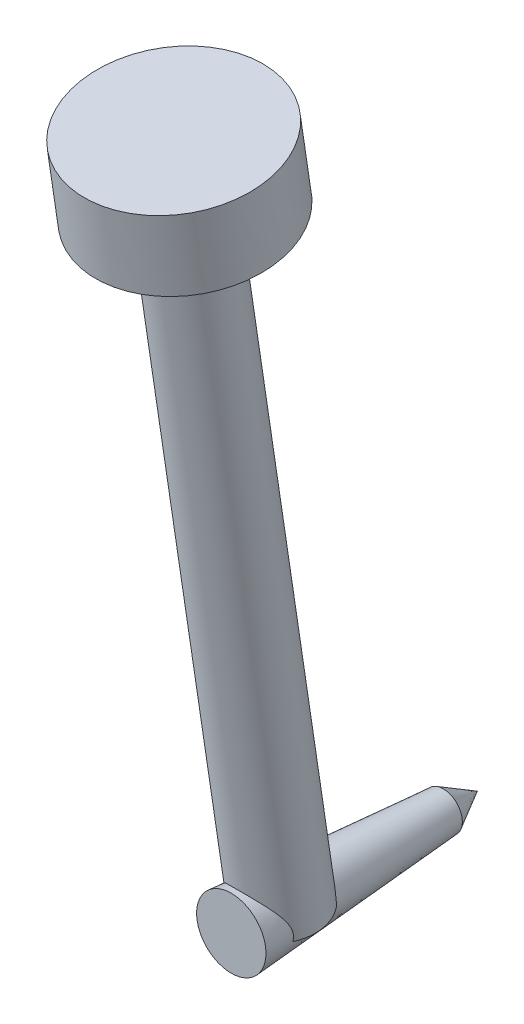
ISO-10303-21;
HEADER;
FILE_DESCRIPTION(('STEP AP214'),'2;1');
FILE_NAME('part.step','',(''),(''),'','','');
FILE_SCHEMA(('AUTOMOTIVE_DESIGN { 1 0 10303 214 1 1 1 1 }'));
ENDSEC;
DATA;
#1=APPLICATION_CONTEXT('core data for automotive mechanical design processes');
#2=APPLICATION_PROTOCOL_DEFINITION('international standard','automotive_design',2000,#1);
#3=PRODUCT_CONTEXT('',#1,'mechanical');
#4=PRODUCT('Part','Part','',(#3));
#5=PRODUCT_RELATED_PRODUCT_CATEGORY('part','',(#4));
#6=PRODUCT_DEFINITION_FORMATION('','',#4);
#7=PRODUCT_DEFINITION_CONTEXT('part definition',#1,'design');
#8=PRODUCT_DEFINITION('design','',#6,#7);
#9=PRODUCT_DEFINITION_SHAPE('','',#8);
#10=(LENGTH_UNIT() NAMED_UNIT(*) SI_UNIT(.MILLI.,.METRE.));
#11=(NAMED_UNIT(*) PLANE_ANGLE_UNIT() SI_UNIT($,.RADIAN.));
#12=(NAMED_UNIT(*) SI_UNIT($,.STERADIAN.) SOLID_ANGLE_UNIT());
#13=UNCERTAINTY_MEASURE_WITH_UNIT(LENGTH_MEASURE(1.E-05),#10,'distance_accuracy_value','');
#14=(GEOMETRIC_REPRESENTATION_CONTEXT(3) GLOBAL_UNCERTAINTY_ASSIGNED_CONTEXT((#13)) GLOBAL_UNIT_ASSIGNED_CONTEXT((#10,
#11,#12)) REPRESENTATION_CONTEXT('',''));
#15=CARTESIAN_POINT('',(0.,0.,0.));
#16=DIRECTION('',(0.,0.,1.));
#17=DIRECTION('',(1.,0.,0.));
#18=AXIS2_PLACEMENT_3D('',#15,#16,#17);
#19=CARTESIAN_POINT('',(357.476877600853,178.279448858378,9.56213503554672));
#20=DIRECTION('',(0.,-0.988978398446851,-0.148059877770789));
#21=DIRECTION('',(0.,0.148059877770789,-0.988978398446851));
#22=AXIS2_PLACEMENT_3D('',#19,#20,#21);
#23=PLANE('',#22);
#24=CARTESIAN_POINT('',(357.476877600853,178.225282840253,9.92394150643039));
#25=DIRECTION('',(0.,-0.988978398446851,-0.148059877770789));
#26=DIRECTION('',(0.,0.148059877770789,-0.988978398446851));
#27=AXIS2_PLACEMENT_3D('',#24,#25,#26);
#28=CIRCLE('',#27,0.731677196290517);
#29=CARTESIAN_POINT('',(357.476877600853,178.333614876503,9.20032856466291));
#30=VERTEX_POINT('',#29);
#31=EDGE_CURVE('E20',#30,#30,#28,.T.);
#32=ORIENTED_EDGE('',*,*,#31,.F.);
#33=EDGE_LOOP('',(#32));
#34=FACE_BOUND('',#33,.T.);
#35=ADVANCED_FACE('F17',(#34),#23,.F.);
#36=CARTESIAN_POINT('',(357.476877600853,172.360827,7.73884299985639));
#37=DIRECTION('',(0.,0.,1.));
#38=DIRECTION('',(1.,0.,0.));
#39=AXIS2_PLACEMENT_3D('',#36,#37,#38);
#40=CONICAL_SURFACE('',#39,0.154049999870676,0.510213050166803);
#41=CARTESIAN_POINT('',(357.476877600853,172.360827,7.73884300002692));
#42=DIRECTION('',(0.,0.,1.));
#43=DIRECTION('',(1.,0.,0.));
#44=AXIS2_PLACEMENT_3D('',#41,#42,#43);
#45=CIRCLE('',#44,0.154049999998573);
#46=CARTESIAN_POINT('',(357.630927600852,172.360827,7.73884300002692));
#47=VERTEX_POINT('',#46);
#48=EDGE_CURVE('E107',#47,#47,#45,.T.);
#49=ORIENTED_EDGE('',*,*,#48,.F.);
#50=EDGE_LOOP('',(#49));
#51=FACE_BOUND('',#50,.T.);
#52=CARTESIAN_POINT('',(357.476877600817,172.360827,7.46357599990688));
#53=VERTEX_POINT('',#52);
#54=VERTEX_LOOP('',#53);
#55=FACE_BOUND('',#54,.T.);
#56=ADVANCED_FACE('F43',(#51,#55),#40,.T.);
#57=CARTESIAN_POINT('',(357.476877600853,177.9184488255,9.87800541036244));
#58=DIRECTION('',(0.,-0.988978398446851,-0.148059877770789));
#59=DIRECTION('',(0.,0.148059877770789,-0.988978398446851));
#60=AXIS2_PLACEMENT_3D('',#57,#58,#59);
#61=CYLINDRICAL_SURFACE('',#60,0.731677196290517);
#62=ORIENTED_EDGE('',*,*,#31,.T.);
#63=EDGE_LOOP('',(#62));
#64=FACE_BOUND('',#63,.T.);
#65=CARTESIAN_POINT('',(357.476877600853,177.611614810746,9.83206931429434));
#66=DIRECTION('',(0.,-0.988978398446851,-0.148059877770789));
#67=DIRECTION('',(0.,0.148059877770789,-0.988978398446851));
#68=AXIS2_PLACEMENT_3D('',#65,#66,#67);
#69=CIRCLE('',#68,0.731677196290517);
#70=CARTESIAN_POINT('',(357.476877600853,177.719946846997,9.10845637252686));
#71=VERTEX_POINT('',#70);
#72=EDGE_CURVE('E106',#71,#71,#69,.T.);
#73=ORIENTED_EDGE('',*,*,#72,.F.);
#74=EDGE_LOOP('',(#73));
#75=FACE_BOUND('',#74,.T.);
#76=ADVANCED_FACE('F45',(#64,#75),#61,.T.);
#77=CARTESIAN_POINT('',(357.476877600853,172.337205102617,9.04243785426944));
#78=DIRECTION('',(0.,0.988978398446817,0.148059877771019));
#79=DIRECTION('',(0.,-0.148059877771019,0.988978398446817));
#80=AXIS2_PLACEMENT_3D('',#77,#78,#79);
#81=CONICAL_SURFACE('',#80,0.312978180908462,1.53269300439733);
#82=CARTESIAN_POINT('',(357.476877600853,172.337205102623,9.04243785427028));
#83=DIRECTION('',(0.,-0.988978398446851,-0.148059877770789));
#84=DIRECTION('',(0.,0.148059877770789,-0.988978398446851));
#85=AXIS2_PLACEMENT_3D('',#82,#83,#84);
#86=CIRCLE('',#85,0.312978180992954);
#87=CARTESIAN_POINT('',(357.241764602328,172.367791985794,8.83813018186664));
#88=VERTEX_POINT('',#87);
#89=CARTESIAN_POINT('',(357.218432545844,172.311068656703,9.21701844168529));
#90=VERTEX_POINT('',#89);
#91=EDGE_CURVE('E124',#88,#90,#86,.F.);
#92=ORIENTED_EDGE('',*,*,#91,.F.);
#93=CARTESIAN_POINT('',(357.218432545847,172.311068656696,9.21701844165659));
#94=CARTESIAN_POINT('',(357.219877363652,172.314633928591,9.1887282875016));
#95=CARTESIAN_POINT('',(357.221355076283,172.318297445781,9.1604509872636));
#96=CARTESIAN_POINT('',(357.224412942472,172.325909132803,9.10394013945038));
#97=CARTESIAN_POINT('',(357.225993097119,172.329857305659,9.07570659234309));
#98=CARTESIAN_POINT('',(357.229291879377,172.338124915108,9.01931198559052));
#99=CARTESIAN_POINT('',(357.231010457254,172.342444218394,8.99115090362851));
#100=CARTESIAN_POINT('',(357.234660214611,172.351414319218,8.93489606017152));
#101=CARTESIAN_POINT('',(357.236591390378,172.356065110965,8.9068022975094));
#102=CARTESIAN_POINT('',(357.239662967337,172.363124823311,8.86519534376648));
#103=CARTESIAN_POINT('',(357.240695477896,172.36544853837,8.85165961852112));
#104=CARTESIAN_POINT('',(357.241764594651,172.367791968896,8.83813027939944));
#105=B_SPLINE_CURVE_WITH_KNOTS('',3,(#93,#94,#95,#96,#97,#98,#99,#100,#101,#102,#103,#104),
.UNSPECIFIED.,.F.,.F.,(4,2,2,2,2,4),(0.,0.0856532156522986,0.171307341095662,0.256930827369804,
0.342552818265336,0.383869998526581),.UNSPECIFIED.);
#106=EDGE_CURVE('E101',#90,#88,#105,.T.);
#107=ORIENTED_EDGE('',*,*,#106,.F.);
#108=EDGE_LOOP('',(#92,#107));
#109=FACE_BOUND('',#108,.T.);
#110=ADVANCED_FACE('F52',(#109),#81,.T.);
#111=CARTESIAN_POINT('',(357.476877600853,172.516053706015,9.45711871768881));
#112=DIRECTION('',(0.,0.,1.));
#113=DIRECTION('',(1.,0.,0.));
#114=AXIS2_PLACEMENT_3D('',#111,#112,#113);
#115=PLANE('',#114);
#116=CARTESIAN_POINT('',(357.476877600853,172.360827,9.45711871770527));
#117=DIRECTION('',(0.,0.,1.));
#118=DIRECTION('',(1.,0.,0.));
#119=AXIS2_PLACEMENT_3D('',#116,#117,#118);
#120=CIRCLE('',#119,0.280919313004159);
#121=CARTESIAN_POINT('',(357.757796913857,172.360827,9.45711871770527));
#122=VERTEX_POINT('',#121);
#123=EDGE_CURVE('E86',#122,#122,#120,.F.);
#124=ORIENTED_EDGE('',*,*,#123,.F.);
#125=EDGE_LOOP('',(#124));
#126=FACE_BOUND('',#125,.T.);
#127=ADVANCED_FACE('F93',(#126),#115,.T.);
#128=CARTESIAN_POINT('',(357.476877600853,172.337205102617,9.04243785426944));
#129=DIRECTION('',(0.,0.988978398446817,0.148059877771019));
#130=DIRECTION('',(0.,-0.148059877771019,0.988978398446817));
#131=AXIS2_PLACEMENT_3D('',#128,#129,#130);
#132=CONICAL_SURFACE('',#131,0.312978180908462,1.53269300449122);
#133=CARTESIAN_POINT('',(357.476877600853,172.337205102624,9.04243785427042));
#134=DIRECTION('',(0.,-0.988978398446851,-0.148059877770789));
#135=DIRECTION('',(0.,0.148059877770789,-0.988978398446851));
#136=AXIS2_PLACEMENT_3D('',#133,#134,#135);
#137=CIRCLE('',#136,0.312978180992954);
#138=CARTESIAN_POINT('',(357.735322653303,172.311068663077,9.21701839111004));
#139=VERTEX_POINT('',#138);
#140=CARTESIAN_POINT('',(357.711990599439,172.367791981331,8.8381301812762));
#141=VERTEX_POINT('',#140);
#142=EDGE_CURVE('E85',#139,#141,#137,.F.);
#143=ORIENTED_EDGE('',*,*,#142,.F.);
#144=CARTESIAN_POINT('',(357.711990606876,172.367791969061,8.83813027945933));
#145=CARTESIAN_POINT('',(357.713060195428,172.365447492697,8.85165915828462));
#146=CARTESIAN_POINT('',(357.714092598552,172.363124079712,8.86519485274302));
#147=CARTESIAN_POINT('',(357.71860169941,172.352760105966,8.92629698743199));
#148=CARTESIAN_POINT('',(357.721704389898,172.345017974174,8.9739431328546));
#149=CARTESIAN_POINT('',(357.727458185194,172.330639498512,9.06942919215804));
#150=CARTESIAN_POINT('',(357.73010927629,172.324003188217,9.11726911187718));
#151=CARTESIAN_POINT('',(357.733545235844,172.315464385764,9.18244108872751));
#152=CARTESIAN_POINT('',(357.734439810342,172.313247501999,9.19972730521269));
#153=CARTESIAN_POINT('',(357.735322650711,172.311068669454,9.2170183405484));
#154=B_SPLINE_CURVE_WITH_KNOTS('',3,(#144,#145,#146,#147,#148,#149,#150,#151,#152,#153),
.UNSPECIFIED.,.F.,.F.,(4,2,2,2,4),(0.,0.0413168526892225,0.18641354746014,0.331514646930496,
0.383866211119147),.UNSPECIFIED.);
#155=EDGE_CURVE('E34',#141,#139,#154,.T.);
#156=ORIENTED_EDGE('',*,*,#155,.F.);
#157=EDGE_LOOP('',(#143,#156));
#158=FACE_BOUND('',#157,.T.);
#159=ADVANCED_FACE('F91',(#158),#132,.T.);
#160=CARTESIAN_POINT('',(357.476877600853,177.688950584484,9.31549851331707));
#161=DIRECTION('',(0.,-0.988978398446851,-0.148059877770789));
#162=DIRECTION('',(0.,0.148059877770789,-0.988978398446851));
#163=AXIS2_PLACEMENT_3D('',#160,#161,#162);
#164=PLANE('',#163);
#165=ORIENTED_EDGE('',*,*,#72,.T.);
#166=EDGE_LOOP('',(#165));
#167=FACE_BOUND('',#166,.T.);
#168=CARTESIAN_POINT('',(357.476877600853,177.611614810747,9.8320693142945));
#169=DIRECTION('',(0.,-0.988978398446851,-0.148059877770789));
#170=DIRECTION('',(0.,0.148059877770789,-0.988978398446851));
#171=AXIS2_PLACEMENT_3D('',#168,#169,#170);
#172=CIRCLE('',#171,0.312978180992954);
#173=CARTESIAN_POINT('',(357.476877600853,177.65795432197,9.52254065410728));
#174=VERTEX_POINT('',#173);
#175=EDGE_CURVE('E11',#174,#174,#172,.T.);
#176=ORIENTED_EDGE('',*,*,#175,.F.);
#177=EDGE_LOOP('',(#176));
#178=FACE_BOUND('',#177,.T.);
#179=ADVANCED_FACE('F65',(#167,#178),#164,.T.);
#180=CARTESIAN_POINT('',(357.476877600853,172.360827,9.45711871753474));
#181=DIRECTION('',(0.,0.,1.));
#182=DIRECTION('',(1.,0.,0.));
#183=AXIS2_PLACEMENT_3D('',#180,#181,#182);
#184=CONICAL_SURFACE('',#183,0.280919312991568,0.0737015102587444);
#185=ORIENTED_EDGE('',*,*,#48,.T.);
#186=EDGE_LOOP('',(#185));
#187=FACE_BOUND('',#186,.T.);
#188=CARTESIAN_POINT('',(357.218432545848,172.31106865671,9.21701844171209));
#189=CARTESIAN_POINT('',(357.216919428819,172.319276991837,9.21599496318446));
#190=CARTESIAN_POINT('',(357.21576593107,172.327617927171,9.21548596499168));
#191=CARTESIAN_POINT('',(357.214186997009,172.344270898889,9.21554508384831));
#192=CARTESIAN_POINT('',(357.21375367365,172.352582239953,9.21610138699486));
#193=CARTESIAN_POINT('',(357.213546976312,172.373486670419,9.21890729924123));
#194=CARTESIAN_POINT('',(357.214251243519,172.385989362689,9.22190412693461));
#195=CARTESIAN_POINT('',(357.217100327657,172.410198232421,9.22988763585298));
#196=CARTESIAN_POINT('',(357.219254662911,172.421898580463,9.23488737594182));
#197=CARTESIAN_POINT('',(357.225847257256,172.448758208641,9.24825774675965));
#198=CARTESIAN_POINT('',(357.230847995697,172.463492234338,9.2571830633841));
#199=CARTESIAN_POINT('',(357.242900465868,172.491459164776,9.27593461617388));
#200=CARTESIAN_POINT('',(357.249956153392,172.504689105198,9.28576256469271));
#201=CARTESIAN_POINT('',(357.266556222692,172.530489588796,9.30604483237211));
#202=CARTESIAN_POINT('',(357.276217712239,172.5429818835,9.31650344476841));
#203=CARTESIAN_POINT('',(357.297921427348,172.566320554932,9.33673437480454));
#204=CARTESIAN_POINT('',(357.309957588303,172.577171002517,9.34650835648133));
#205=CARTESIAN_POINT('',(357.332675354928,172.593980686058,9.36196734636774));
#206=CARTESIAN_POINT('',(357.342734379987,172.600445060706,9.36801527551989));
#207=CARTESIAN_POINT('',(357.364111921263,172.612106314738,9.37903782352254));
#208=CARTESIAN_POINT('',(357.375429345254,172.617304280982,9.3840133622968));
#209=CARTESIAN_POINT('',(357.397200989659,172.62538774338,9.39179955376058));
#210=CARTESIAN_POINT('',(357.40748547777,172.628514108614,9.39483267629465));
#211=CARTESIAN_POINT('',(357.428628620539,172.63347946677,9.3996640744289));
#212=CARTESIAN_POINT('',(357.439485744851,172.635321720837,9.40146547789505));
#213=CARTESIAN_POINT('',(357.454844443228,172.636909165074,9.40301893309979));
#214=CARTESIAN_POINT('',(357.459236392672,172.637249129403,9.40335184091259));
#215=CARTESIAN_POINT('',(357.468043913292,172.637703540933,9.40379694974248));
#216=CARTESIAN_POINT('',(357.472459489648,172.637817936454,9.4039091001821));
#217=CARTESIAN_POINT('',(357.488573710478,172.637816473716,9.40390750396446));
#218=CARTESIAN_POINT('',(357.500287584959,172.637010889007,9.40311729998365));
#219=CARTESIAN_POINT('',(357.523312661182,172.633856263241,9.40003375426241));
#220=CARTESIAN_POINT('',(357.534622851967,172.631503599555,9.39773688455554));
#221=CARTESIAN_POINT('',(357.556420258617,172.62546295634,9.39187485102698));
#222=CARTESIAN_POINT('',(357.56691336571,172.621785876868,9.38832004420426));
#223=CARTESIAN_POINT('',(357.587003775477,172.613310981507,9.38019636600992));
#224=CARTESIAN_POINT('',(357.596600854615,172.608512886994,9.37562724254738));
#225=CARTESIAN_POINT('',(357.619089287618,172.595539902681,9.36341319944532));
#226=CARTESIAN_POINT('',(357.631433241881,172.586833064657,9.35532685095703));
#227=CARTESIAN_POINT('',(357.654093871914,172.567881629521,9.33817079040198));
#228=CARTESIAN_POINT('',(357.664405996171,172.557633668607,9.32909893961705));
#229=CARTESIAN_POINT('',(357.683387512486,172.535506951709,9.31025469015075));
#230=CARTESIAN_POINT('',(357.691995807327,172.523587375034,9.30046927677296));
#231=CARTESIAN_POINT('',(357.707244426072,172.498410965302,9.28107664229436));
#232=CARTESIAN_POINT('',(357.713885180015,172.48515442531,9.27146938268609));
#233=CARTESIAN_POINT('',(357.723536590016,172.461147338554,9.25589875927016));
#234=CARTESIAN_POINT('',(357.727042309751,172.450763107395,9.24967860205268));
#235=CARTESIAN_POINT('',(357.732915512755,172.429146958518,9.23827825749902));
#236=CARTESIAN_POINT('',(357.735286706714,172.417917945242,9.23309471255029));
#237=CARTESIAN_POINT('',(357.738068169384,172.398973458078,9.22605594697055));
#238=CARTESIAN_POINT('',(357.738880039829,172.391511714635,9.22368066487106));
#239=CARTESIAN_POINT('',(357.739926132791,172.376329781641,9.21977799422842));
#240=CARTESIAN_POINT('',(357.740160855477,172.368609821754,9.21824987240834));
#241=CARTESIAN_POINT('',(357.740000434824,172.352563066266,9.21610181653639));
#242=CARTESIAN_POINT('',(357.739565457992,172.344228258562,9.21554386358309));
#243=CARTESIAN_POINT('',(357.737983657894,172.327572951774,9.21548699832951));
#244=CARTESIAN_POINT('',(357.736832680565,172.319252822368,9.21599430751704));
#245=CARTESIAN_POINT('',(357.735322660694,172.311068683042,9.21701843850784));
#246=B_SPLINE_CURVE_WITH_KNOTS('',3,(#188,#189,#190,#191,#192,#193,#194,#195,#196,#197,#198,
#199,#200,#201,#202,#203,#204,#205,#206,#207,#208,#209,#210,#211,#212,#213,#214,#215,#216,#217,
#218,#219,#220,#221,#222,#223,#224,#225,#226,#227,#228,#229,#230,#231,#232,#233,#234,#235,#236,
#237,#238,#239,#240,#241,#242,#243,#244,#245),.UNSPECIFIED.,.F.,.F.,(4,2,2,2,2,2,2,2,2,2,2,2,2,
2,2,2,2,2,2,2,2,2,2,2,2,2,2,2,4),(0.,0.0252058480193424,0.0501337879346062,0.0884101600875615,
0.12694026270609,0.180460422798161,0.234084298382531,0.290706929914265,0.347186783887342,
0.387255792034662,0.427290289945087,0.460663024269322,0.493950692901809,0.507194227130227,
0.520440795216767,0.555508566331166,0.590658745692657,0.6255260095088,0.66040194870385,
0.711520616836844,0.762752525836631,0.815578515491329,0.868392950630392,0.906116014267364,
0.943714839158881,0.967273860569215,0.99081245801915,1.01580614480889,1.04094620898359),.UNSPECIFIED.);
#247=EDGE_CURVE('E78',#90,#139,#246,.T.);
#248=ORIENTED_EDGE('',*,*,#247,.F.);
#249=ORIENTED_EDGE('',*,*,#106,.T.);
#250=CARTESIAN_POINT('',(357.711990533992,172.36779198956,8.83813010716752));
#251=CARTESIAN_POINT('',(357.711814627927,172.377572781261,8.83941284897881));
#252=CARTESIAN_POINT('',(357.71092707505,172.387395741449,8.83983946352172));
#253=CARTESIAN_POINT('',(357.707869281195,172.406661265909,8.83928262110726));
#254=CARTESIAN_POINT('',(357.705717806871,172.416107279259,8.83831950026769));
#255=CARTESIAN_POINT('',(357.700276782627,172.43440174139,8.83531407350806));
#256=CARTESIAN_POINT('',(357.696994047228,172.443253397419,8.83327819172218));
#257=CARTESIAN_POINT('',(357.689422475579,172.460353191302,8.82851368302414));
#258=CARTESIAN_POINT('',(357.685129110016,172.468598386218,8.82578193279111));
#259=CARTESIAN_POINT('',(357.673336139742,172.48826234091,8.81852225168997));
#260=CARTESIAN_POINT('',(357.665293040648,172.499272662732,8.81376719324076));
#261=CARTESIAN_POINT('',(357.647443012781,172.519715405916,8.80418996292752));
#262=CARTESIAN_POINT('',(357.63763516274,172.52914699813,8.79936775722891));
#263=CARTESIAN_POINT('',(357.616319893133,172.546346398686,8.79015920227445));
#264=CARTESIAN_POINT('',(357.604799573853,172.554100374425,8.78577662551506));
#265=CARTESIAN_POINT('',(357.580340817798,172.567577830105,8.77795733536985));
#266=CARTESIAN_POINT('',(357.567404185746,172.573303855613,8.77451943740845));
#267=CARTESIAN_POINT('',(357.541697989573,172.582015045965,8.76922065754589));
#268=CARTESIAN_POINT('',(357.529021598469,172.585203175963,8.76724419660309));
#269=CARTESIAN_POINT('',(357.503188092228,172.589475874919,8.76458546432621));
#270=CARTESIAN_POINT('',(357.490031337277,172.590561988293,8.7639022428173));
#271=CARTESIAN_POINT('',(357.464844674237,172.590562914172,8.76390143554736));
#272=CARTESIAN_POINT('',(357.452814273657,172.589654854203,8.76447244656704));
#273=CARTESIAN_POINT('',(357.429124314651,172.58607486759,8.76670298665582));
#274=CARTESIAN_POINT('',(357.417464794513,172.583402759459,8.7683626277254));
#275=CARTESIAN_POINT('',(357.394876761618,172.576441575203,8.7726184503143));
#276=CARTESIAN_POINT('',(357.383945636733,172.572158688934,8.77521104507679));
#277=CARTESIAN_POINT('',(357.362987545735,172.562143949582,8.78112981287144));
#278=CARTESIAN_POINT('',(357.352960836297,172.556411686908,8.78445619323571));
#279=CARTESIAN_POINT('',(357.333160552135,172.543123115877,8.79190160426147));
#280=CARTESIAN_POINT('',(357.323479334296,172.535453881495,8.79606378810948));
#281=CARTESIAN_POINT('',(357.305473702516,172.518751787916,8.80461438227953));
#282=CARTESIAN_POINT('',(357.297150661492,172.50971756646,8.8090030156844));
#283=CARTESIAN_POINT('',(357.282464488392,172.49098638984,8.81729184610945));
#284=CARTESIAN_POINT('',(357.276011518069,172.481365865089,8.82120543661401));
#285=CARTESIAN_POINT('',(357.264565135824,172.461054453529,8.82833585302597));
#286=CARTESIAN_POINT('',(357.259569007643,172.450365609223,8.83155397268854));
#287=CARTESIAN_POINT('',(357.252438081177,172.431178974393,8.83590034920998));
#288=CARTESIAN_POINT('',(357.249893734555,172.422910517977,8.83736182634943));
#289=CARTESIAN_POINT('',(357.245796664495,172.406027137954,8.83928158480557));
#290=CARTESIAN_POINT('',(357.244240926524,172.397413353582,8.83974292628203));
#291=CARTESIAN_POINT('',(357.242801955353,172.385266315745,8.8395576083797));
#292=CARTESIAN_POINT('',(357.242474721878,172.381770185956,8.83940801749324));
#293=CARTESIAN_POINT('',(357.241991331927,172.374777021499,8.83891491805453));
#294=CARTESIAN_POINT('',(357.241835309239,172.371279988256,8.83857125816945));
#295=CARTESIAN_POINT('',(357.241764609946,172.367791996762,8.83813008351455));
#296=B_SPLINE_CURVE_WITH_KNOTS('',3,(#250,#251,#252,#253,#254,#255,#256,#257,#258,#259,#260,
#261,#262,#263,#264,#265,#266,#267,#268,#269,#270,#271,#272,#273,#274,#275,#276,#277,#278,#279,
#280,#281,#282,#283,#284,#285,#286,#287,#288,#289,#290,#291,#292,#293,#294,#295),.UNSPECIFIED.,
.F.,.F.,(4,2,2,2,2,2,2,2,2,2,2,2,2,2,2,2,2,2,2,2,2,2,4),(0.,0.0294568842094779,
0.0584870698063158,0.0873453539924689,0.116335520315641,0.159434697781834,0.202556440323527,
0.24602122469934,0.289431255278865,0.328866289907606,0.368272339382666,0.404320659514864,
0.440372688953799,0.476287571107021,0.512212614085885,0.551161753344343,0.590150023818417,
0.626707632183563,0.663196637133672,0.689422501242097,0.715568006974842,0.726103790009804,
0.736647800097678),.UNSPECIFIED.);
#297=EDGE_CURVE('E26',#141,#88,#296,.T.);
#298=ORIENTED_EDGE('',*,*,#297,.F.);
#299=ORIENTED_EDGE('',*,*,#155,.T.);
#300=EDGE_LOOP('',(#248,#249,#298,#299));
#301=FACE_BOUND('',#300,.T.);
#302=ORIENTED_EDGE('',*,*,#123,.T.);
#303=EDGE_LOOP('',(#302));
#304=FACE_BOUND('',#303,.T.);
#305=ADVANCED_FACE('F59',(#187,#301,#304),#184,.T.);
#306=CARTESIAN_POINT('',(357.476877600853,175.963388355133,9.58531346205336));
#307=DIRECTION('',(0.,-0.988978398446851,-0.148059877770789));
#308=DIRECTION('',(0.,0.148059877770789,-0.988978398446851));
#309=AXIS2_PLACEMENT_3D('',#306,#307,#308);
#310=CYLINDRICAL_SURFACE('',#309,0.312978180992954);
#311=ORIENTED_EDGE('',*,*,#175,.T.);
#312=EDGE_LOOP('',(#311));
#313=FACE_BOUND('',#312,.T.);
#314=ORIENTED_EDGE('',*,*,#297,.T.);
#315=ORIENTED_EDGE('',*,*,#91,.T.);
#316=ORIENTED_EDGE('',*,*,#247,.T.);
#317=ORIENTED_EDGE('',*,*,#142,.T.);
#318=EDGE_LOOP('',(#314,#315,#316,#317));
#319=FACE_BOUND('',#318,.T.);
#320=ADVANCED_FACE('F57',(#313,#319),#310,.T.);
#321=CLOSED_SHELL('',(#35,#56,#76,#110,#127,#159,#179,#305,#320));
#322=MANIFOLD_SOLID_BREP('B1',#321);
#323=ADVANCED_BREP_SHAPE_REPRESENTATION('',(#18,#322),#14);
#324=SHAPE_DEFINITION_REPRESENTATION(#9,#323);
ENDSEC;
END-ISO-10303-21;
